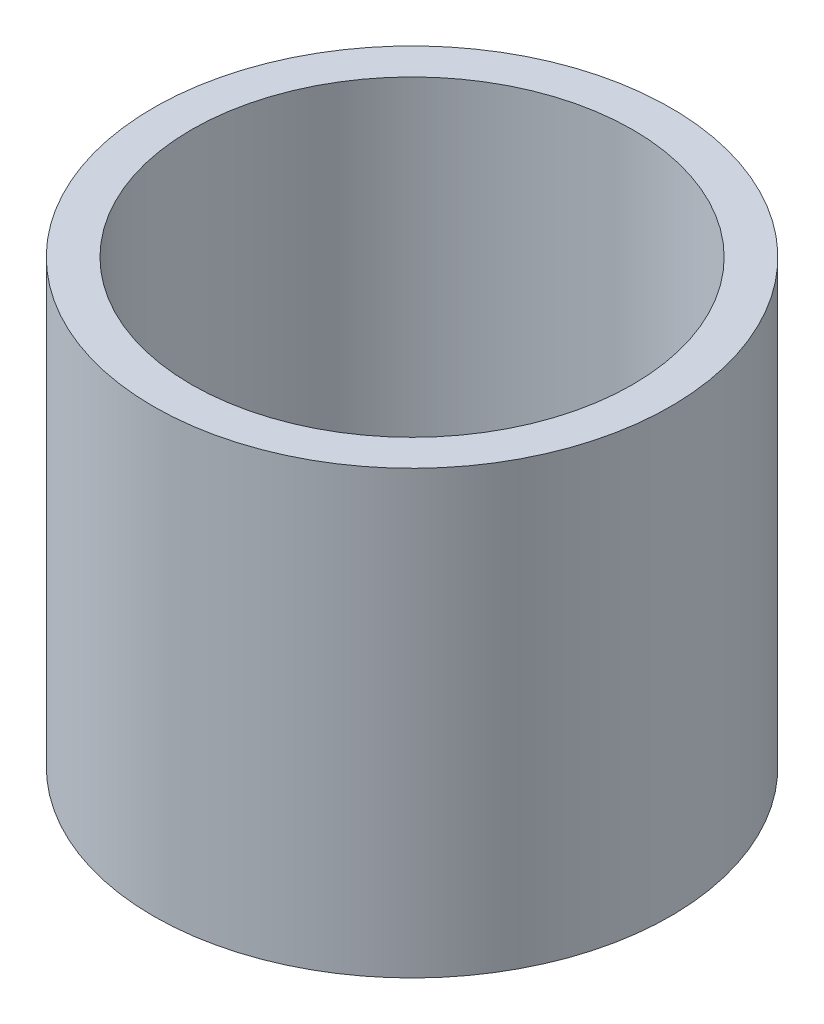
ISO-10303-21;
HEADER;
FILE_DESCRIPTION(('STEP AP214'),'2;1');
FILE_NAME('part.step','',(''),(''),'','','');
FILE_SCHEMA(('AUTOMOTIVE_DESIGN { 1 0 10303 214 1 1 1 1 }'));
ENDSEC;
DATA;
#1=APPLICATION_CONTEXT('core data for automotive mechanical design processes');
#2=APPLICATION_PROTOCOL_DEFINITION('international standard','automotive_design',2000,#1);
#3=PRODUCT_CONTEXT('',#1,'mechanical');
#4=PRODUCT('Part','Part','',(#3));
#5=PRODUCT_RELATED_PRODUCT_CATEGORY('part','',(#4));
#6=PRODUCT_DEFINITION_FORMATION('','',#4);
#7=PRODUCT_DEFINITION_CONTEXT('part definition',#1,'design');
#8=PRODUCT_DEFINITION('design','',#6,#7);
#9=PRODUCT_DEFINITION_SHAPE('','',#8);
#10=(LENGTH_UNIT() NAMED_UNIT(*) SI_UNIT(.MILLI.,.METRE.));
#11=(NAMED_UNIT(*) PLANE_ANGLE_UNIT() SI_UNIT($,.RADIAN.));
#12=(NAMED_UNIT(*) SI_UNIT($,.STERADIAN.) SOLID_ANGLE_UNIT());
#13=UNCERTAINTY_MEASURE_WITH_UNIT(LENGTH_MEASURE(1.E-05),#10,'distance_accuracy_value','');
#14=(GEOMETRIC_REPRESENTATION_CONTEXT(3) GLOBAL_UNCERTAINTY_ASSIGNED_CONTEXT((#13)) GLOBAL_UNIT_ASSIGNED_CONTEXT((#10,
#11,#12)) REPRESENTATION_CONTEXT('',''));
#15=CARTESIAN_POINT('',(0.,0.,0.));
#16=DIRECTION('',(0.,0.,1.));
#17=DIRECTION('',(1.,0.,0.));
#18=AXIS2_PLACEMENT_3D('',#15,#16,#17);
#19=CARTESIAN_POINT('',(0.,0.,0.));
#20=DIRECTION('',(0.,1.,0.));
#21=DIRECTION('',(0.,0.,1.));
#22=AXIS2_PLACEMENT_3D('',#19,#20,#21);
#23=CYLINDRICAL_SURFACE('',#22,6.35);
#24=CARTESIAN_POINT('',(0.,0.,0.));
#25=DIRECTION('',(0.,1.,0.));
#26=DIRECTION('',(0.,0.,1.));
#27=AXIS2_PLACEMENT_3D('',#24,#25,#26);
#28=CIRCLE('',#27,6.35);
#29=CARTESIAN_POINT('',(0.,0.,6.35));
#30=VERTEX_POINT('',#29);
#31=EDGE_CURVE('E54',#30,#30,#28,.T.);
#32=ORIENTED_EDGE('',*,*,#31,.T.);
#33=EDGE_LOOP('',(#32));
#34=FACE_BOUND('',#33,.T.);
#35=CARTESIAN_POINT('',(0.,-12.7,0.));
#36=DIRECTION('',(0.,1.,0.));
#37=DIRECTION('',(0.,0.,1.));
#38=AXIS2_PLACEMENT_3D('',#35,#36,#37);
#39=CIRCLE('',#38,6.35);
#40=CARTESIAN_POINT('',(0.,-12.7,6.35));
#41=VERTEX_POINT('',#40);
#42=EDGE_CURVE('E10',#41,#41,#39,.T.);
#43=ORIENTED_EDGE('',*,*,#42,.F.);
#44=EDGE_LOOP('',(#43));
#45=FACE_BOUND('',#44,.T.);
#46=ADVANCED_FACE('F37',(#34,#45),#23,.F.);
#47=CARTESIAN_POINT('',(-6.35,-12.7,0.));
#48=DIRECTION('',(0.,-1.,0.));
#49=DIRECTION('',(0.,0.,-1.));
#50=AXIS2_PLACEMENT_3D('',#47,#48,#49);
#51=PLANE('',#50);
#52=ORIENTED_EDGE('',*,*,#42,.T.);
#53=EDGE_LOOP('',(#52));
#54=FACE_BOUND('',#53,.T.);
#55=CARTESIAN_POINT('',(0.,-12.7,0.));
#56=DIRECTION('',(0.,1.,0.));
#57=DIRECTION('',(0.,0.,1.));
#58=AXIS2_PLACEMENT_3D('',#55,#56,#57);
#59=CIRCLE('',#58,7.4422);
#60=CARTESIAN_POINT('',(0.,-12.7,7.4422));
#61=VERTEX_POINT('',#60);
#62=EDGE_CURVE('E44',#61,#61,#59,.T.);
#63=ORIENTED_EDGE('',*,*,#62,.F.);
#64=EDGE_LOOP('',(#63));
#65=FACE_BOUND('',#64,.T.);
#66=ADVANCED_FACE('F71',(#54,#65),#51,.T.);
#67=CARTESIAN_POINT('',(0.,0.,0.));
#68=DIRECTION('',(0.,1.,0.));
#69=DIRECTION('',(0.,0.,1.));
#70=AXIS2_PLACEMENT_3D('',#67,#68,#69);
#71=CYLINDRICAL_SURFACE('',#70,7.4422);
#72=ORIENTED_EDGE('',*,*,#62,.T.);
#73=EDGE_LOOP('',(#72));
#74=FACE_BOUND('',#73,.T.);
#75=CARTESIAN_POINT('',(0.,0.,0.));
#76=DIRECTION('',(0.,1.,0.));
#77=DIRECTION('',(0.,0.,1.));
#78=AXIS2_PLACEMENT_3D('',#75,#76,#77);
#79=CIRCLE('',#78,7.4422);
#80=CARTESIAN_POINT('',(0.,0.,7.4422));
#81=VERTEX_POINT('',#80);
#82=EDGE_CURVE('E49',#81,#81,#79,.T.);
#83=ORIENTED_EDGE('',*,*,#82,.F.);
#84=EDGE_LOOP('',(#83));
#85=FACE_BOUND('',#84,.T.);
#86=ADVANCED_FACE('F65',(#74,#85),#71,.T.);
#87=CARTESIAN_POINT('',(-6.35,0.,0.));
#88=DIRECTION('',(0.,1.,0.));
#89=DIRECTION('',(0.,0.,1.));
#90=AXIS2_PLACEMENT_3D('',#87,#88,#89);
#91=PLANE('',#90);
#92=ORIENTED_EDGE('',*,*,#82,.T.);
#93=EDGE_LOOP('',(#92));
#94=FACE_BOUND('',#93,.T.);
#95=ORIENTED_EDGE('',*,*,#31,.F.);
#96=EDGE_LOOP('',(#95));
#97=FACE_BOUND('',#96,.T.);
#98=ADVANCED_FACE('F63',(#94,#97),#91,.T.);
#99=CLOSED_SHELL('',(#46,#66,#86,#98));
#100=MANIFOLD_SOLID_BREP('B2',#99);
#101=ADVANCED_BREP_SHAPE_REPRESENTATION('',(#18,#100),#14);
#102=SHAPE_DEFINITION_REPRESENTATION(#9,#101);
ENDSEC;
END-ISO-10303-21;
